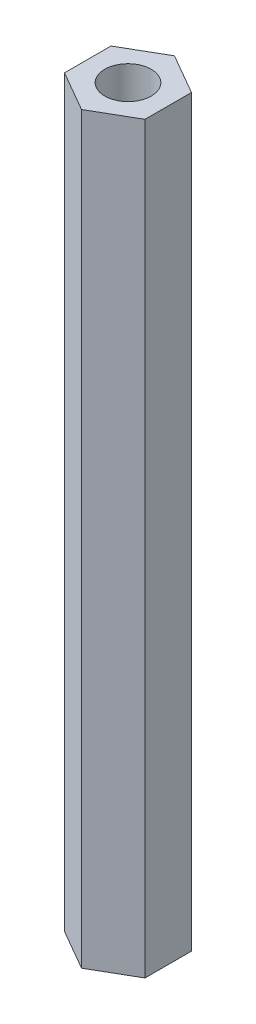
ISO-10303-21;
HEADER;
FILE_DESCRIPTION(('STEP AP214'),'2;1');
FILE_NAME('part.step','',(''),(''),'','','');
FILE_SCHEMA(('AUTOMOTIVE_DESIGN { 1 0 10303 214 1 1 1 1 }'));
ENDSEC;
DATA;
#1=APPLICATION_CONTEXT('core data for automotive mechanical design processes');
#2=APPLICATION_PROTOCOL_DEFINITION('international standard','automotive_design',2000,#1);
#3=PRODUCT_CONTEXT('',#1,'mechanical');
#4=PRODUCT('Part','Part','',(#3));
#5=PRODUCT_RELATED_PRODUCT_CATEGORY('part','',(#4));
#6=PRODUCT_DEFINITION_FORMATION('','',#4);
#7=PRODUCT_DEFINITION_CONTEXT('part definition',#1,'design');
#8=PRODUCT_DEFINITION('design','',#6,#7);
#9=PRODUCT_DEFINITION_SHAPE('','',#8);
#10=(LENGTH_UNIT() NAMED_UNIT(*) SI_UNIT(.MILLI.,.METRE.));
#11=(NAMED_UNIT(*) PLANE_ANGLE_UNIT() SI_UNIT($,.RADIAN.));
#12=(NAMED_UNIT(*) SI_UNIT($,.STERADIAN.) SOLID_ANGLE_UNIT());
#13=UNCERTAINTY_MEASURE_WITH_UNIT(LENGTH_MEASURE(1.E-05),#10,'distance_accuracy_value','');
#14=(GEOMETRIC_REPRESENTATION_CONTEXT(3) GLOBAL_UNCERTAINTY_ASSIGNED_CONTEXT((#13)) GLOBAL_UNIT_ASSIGNED_CONTEXT((#10,
#11,#12)) REPRESENTATION_CONTEXT('',''));
#15=CARTESIAN_POINT('',(0.,0.,0.));
#16=DIRECTION('',(0.,0.,1.));
#17=DIRECTION('',(1.,0.,0.));
#18=AXIS2_PLACEMENT_3D('',#15,#16,#17);
#19=CARTESIAN_POINT('',(0.,80.,-5.));
#20=DIRECTION('',(0.,1.,0.));
#21=DIRECTION('',(0.,0.,1.));
#22=AXIS2_PLACEMENT_3D('',#19,#20,#21);
#23=PLANE('',#22);
#24=DIRECTION('',(-0.866025403784439,0.,-0.5));
#25=VECTOR('',#24,1.);
#26=CARTESIAN_POINT('',(4.33012701892219,80.,-2.5));
#27=LINE('',#26,#25);
#28=CARTESIAN_POINT('',(4.33012701892219,80.,-2.5));
#29=VERTEX_POINT('',#28);
#30=CARTESIAN_POINT('',(0.,80.,-5.));
#31=VERTEX_POINT('',#30);
#32=EDGE_CURVE('E127',#29,#31,#27,.T.);
#33=ORIENTED_EDGE('',*,*,#32,.T.);
#34=DIRECTION('',(-0.866025403784439,0.,0.5));
#35=VECTOR('',#34,1.);
#36=CARTESIAN_POINT('',(0.,80.,-5.));
#37=LINE('',#36,#35);
#38=CARTESIAN_POINT('',(-4.33012701892219,80.,-2.5));
#39=VERTEX_POINT('',#38);
#40=EDGE_CURVE('E85',#31,#39,#37,.T.);
#41=ORIENTED_EDGE('',*,*,#40,.T.);
#42=DIRECTION('',(0.,0.,1.));
#43=VECTOR('',#42,1.);
#44=CARTESIAN_POINT('',(-4.33012701892219,80.,-2.5));
#45=LINE('',#44,#43);
#46=CARTESIAN_POINT('',(-4.33012701892219,80.,2.5));
#47=VERTEX_POINT('',#46);
#48=EDGE_CURVE('E98',#39,#47,#45,.T.);
#49=ORIENTED_EDGE('',*,*,#48,.T.);
#50=DIRECTION('',(0.866025403784439,0.,0.5));
#51=VECTOR('',#50,1.);
#52=CARTESIAN_POINT('',(-4.33012701892219,80.,2.5));
#53=LINE('',#52,#51);
#54=CARTESIAN_POINT('',(0.,80.,5.));
#55=VERTEX_POINT('',#54);
#56=EDGE_CURVE('E92',#47,#55,#53,.T.);
#57=ORIENTED_EDGE('',*,*,#56,.T.);
#58=DIRECTION('',(0.866025403784439,0.,-0.5));
#59=VECTOR('',#58,1.);
#60=CARTESIAN_POINT('',(0.,80.,5.));
#61=LINE('',#60,#59);
#62=CARTESIAN_POINT('',(4.33012701892219,80.,2.5));
#63=VERTEX_POINT('',#62);
#64=EDGE_CURVE('E96',#55,#63,#61,.T.);
#65=ORIENTED_EDGE('',*,*,#64,.T.);
#66=DIRECTION('',(0.,0.,-1.));
#67=VECTOR('',#66,1.);
#68=CARTESIAN_POINT('',(4.33012701892219,80.,2.5));
#69=LINE('',#68,#67);
#70=EDGE_CURVE('E48',#63,#29,#69,.T.);
#71=ORIENTED_EDGE('',*,*,#70,.T.);
#72=EDGE_LOOP('',(#33,#41,#49,#57,#65,#71));
#73=FACE_BOUND('',#72,.T.);
#74=CARTESIAN_POINT('',(0.,80.,0.));
#75=DIRECTION('',(0.,1.,0.));
#76=DIRECTION('',(0.,0.,1.));
#77=AXIS2_PLACEMENT_3D('',#74,#75,#76);
#78=CIRCLE('',#77,2.5);
#79=CARTESIAN_POINT('',(0.,80.,2.5));
#80=VERTEX_POINT('',#79);
#81=EDGE_CURVE('E120',#80,#80,#78,.T.);
#82=ORIENTED_EDGE('',*,*,#81,.F.);
#83=EDGE_LOOP('',(#82));
#84=FACE_BOUND('',#83,.T.);
#85=ADVANCED_FACE('F31',(#73,#84),#23,.T.);
#86=CARTESIAN_POINT('',(0.,0.,-5.));
#87=DIRECTION('',(0.,1.,0.));
#88=DIRECTION('',(0.,0.,1.));
#89=AXIS2_PLACEMENT_3D('',#86,#87,#88);
#90=PLANE('',#89);
#91=DIRECTION('',(-0.866025403784439,0.,-0.5));
#92=VECTOR('',#91,1.);
#93=CARTESIAN_POINT('',(4.33012701892219,0.,-2.5));
#94=LINE('',#93,#92);
#95=CARTESIAN_POINT('',(4.33012701892219,0.,-2.5));
#96=VERTEX_POINT('',#95);
#97=CARTESIAN_POINT('',(0.,0.,-5.));
#98=VERTEX_POINT('',#97);
#99=EDGE_CURVE('E116',#96,#98,#94,.T.);
#100=ORIENTED_EDGE('',*,*,#99,.F.);
#101=DIRECTION('',(0.,0.,-1.));
#102=VECTOR('',#101,1.);
#103=CARTESIAN_POINT('',(4.33012701892219,0.,2.5));
#104=LINE('',#103,#102);
#105=CARTESIAN_POINT('',(4.33012701892219,0.,2.5));
#106=VERTEX_POINT('',#105);
#107=EDGE_CURVE('E77',#106,#96,#104,.T.);
#108=ORIENTED_EDGE('',*,*,#107,.F.);
#109=DIRECTION('',(0.866025403784439,0.,-0.5));
#110=VECTOR('',#109,1.);
#111=CARTESIAN_POINT('',(0.,0.,5.));
#112=LINE('',#111,#110);
#113=CARTESIAN_POINT('',(0.,0.,5.));
#114=VERTEX_POINT('',#113);
#115=EDGE_CURVE('E71',#114,#106,#112,.T.);
#116=ORIENTED_EDGE('',*,*,#115,.F.);
#117=DIRECTION('',(0.866025403784439,0.,0.5));
#118=VECTOR('',#117,1.);
#119=CARTESIAN_POINT('',(-4.33012701892219,0.,2.5));
#120=LINE('',#119,#118);
#121=CARTESIAN_POINT('',(-4.33012701892219,0.,2.5));
#122=VERTEX_POINT('',#121);
#123=EDGE_CURVE('E106',#122,#114,#120,.T.);
#124=ORIENTED_EDGE('',*,*,#123,.F.);
#125=DIRECTION('',(0.,0.,1.));
#126=VECTOR('',#125,1.);
#127=CARTESIAN_POINT('',(-4.33012701892219,0.,-2.5));
#128=LINE('',#127,#126);
#129=CARTESIAN_POINT('',(-4.33012701892219,0.,-2.5));
#130=VERTEX_POINT('',#129);
#131=EDGE_CURVE('E122',#130,#122,#128,.T.);
#132=ORIENTED_EDGE('',*,*,#131,.F.);
#133=DIRECTION('',(-0.866025403784439,0.,0.5));
#134=VECTOR('',#133,1.);
#135=CARTESIAN_POINT('',(0.,0.,-5.));
#136=LINE('',#135,#134);
#137=EDGE_CURVE('E119',#98,#130,#136,.T.);
#138=ORIENTED_EDGE('',*,*,#137,.F.);
#139=EDGE_LOOP('',(#100,#108,#116,#124,#132,#138));
#140=FACE_BOUND('',#139,.T.);
#141=CARTESIAN_POINT('',(0.,0.,0.));
#142=DIRECTION('',(0.,1.,0.));
#143=DIRECTION('',(0.,0.,1.));
#144=AXIS2_PLACEMENT_3D('',#141,#142,#143);
#145=CIRCLE('',#144,2.5);
#146=CARTESIAN_POINT('',(0.,0.,2.5));
#147=VERTEX_POINT('',#146);
#148=EDGE_CURVE('E220',#147,#147,#145,.T.);
#149=ORIENTED_EDGE('',*,*,#148,.T.);
#150=EDGE_LOOP('',(#149));
#151=FACE_BOUND('',#150,.T.);
#152=ADVANCED_FACE('F136',(#140,#151),#90,.F.);
#153=CARTESIAN_POINT('',(4.33012701892219,80.,-2.5));
#154=DIRECTION('',(-0.5,0.,0.866025403784439));
#155=DIRECTION('',(0.866025403784439,0.,0.5));
#156=AXIS2_PLACEMENT_3D('',#153,#154,#155);
#157=PLANE('',#156);
#158=ORIENTED_EDGE('',*,*,#99,.T.);
#159=DIRECTION('',(0.,-1.,0.));
#160=VECTOR('',#159,1.);
#161=CARTESIAN_POINT('',(0.,80.,-5.));
#162=LINE('',#161,#160);
#163=EDGE_CURVE('E11',#31,#98,#162,.T.);
#164=ORIENTED_EDGE('',*,*,#163,.F.);
#165=ORIENTED_EDGE('',*,*,#32,.F.);
#166=DIRECTION('',(0.,-1.,0.));
#167=VECTOR('',#166,1.);
#168=CARTESIAN_POINT('',(4.33012701892219,80.,-2.5));
#169=LINE('',#168,#167);
#170=EDGE_CURVE('E112',#29,#96,#169,.T.);
#171=ORIENTED_EDGE('',*,*,#170,.T.);
#172=EDGE_LOOP('',(#158,#164,#165,#171));
#173=FACE_BOUND('',#172,.T.);
#174=ADVANCED_FACE('F33',(#173),#157,.F.);
#175=CARTESIAN_POINT('',(0.,80.,-5.));
#176=DIRECTION('',(0.5,0.,0.866025403784439));
#177=DIRECTION('',(0.866025403784439,0.,-0.5));
#178=AXIS2_PLACEMENT_3D('',#175,#176,#177);
#179=PLANE('',#178);
#180=ORIENTED_EDGE('',*,*,#137,.T.);
#181=DIRECTION('',(0.,-1.,0.));
#182=VECTOR('',#181,1.);
#183=CARTESIAN_POINT('',(-4.33012701892219,80.,-2.5));
#184=LINE('',#183,#182);
#185=EDGE_CURVE('E40',#39,#130,#184,.T.);
#186=ORIENTED_EDGE('',*,*,#185,.F.);
#187=ORIENTED_EDGE('',*,*,#40,.F.);
#188=ORIENTED_EDGE('',*,*,#163,.T.);
#189=EDGE_LOOP('',(#180,#186,#187,#188));
#190=FACE_BOUND('',#189,.T.);
#191=ADVANCED_FACE('F161',(#190),#179,.F.);
#192=CARTESIAN_POINT('',(-4.33012701892219,80.,-2.5));
#193=DIRECTION('',(1.,0.,0.));
#194=DIRECTION('',(0.,0.,-1.));
#195=AXIS2_PLACEMENT_3D('',#192,#193,#194);
#196=PLANE('',#195);
#197=ORIENTED_EDGE('',*,*,#131,.T.);
#198=DIRECTION('',(0.,-1.,0.));
#199=VECTOR('',#198,1.);
#200=CARTESIAN_POINT('',(-4.33012701892219,80.,2.5));
#201=LINE('',#200,#199);
#202=EDGE_CURVE('E107',#47,#122,#201,.T.);
#203=ORIENTED_EDGE('',*,*,#202,.F.);
#204=ORIENTED_EDGE('',*,*,#48,.F.);
#205=ORIENTED_EDGE('',*,*,#185,.T.);
#206=EDGE_LOOP('',(#197,#203,#204,#205));
#207=FACE_BOUND('',#206,.T.);
#208=ADVANCED_FACE('F133',(#207),#196,.F.);
#209=CARTESIAN_POINT('',(-4.33012701892219,80.,2.5));
#210=DIRECTION('',(0.5,0.,-0.866025403784439));
#211=DIRECTION('',(-0.866025403784439,0.,-0.5));
#212=AXIS2_PLACEMENT_3D('',#209,#210,#211);
#213=PLANE('',#212);
#214=ORIENTED_EDGE('',*,*,#123,.T.);
#215=DIRECTION('',(0.,-1.,0.));
#216=VECTOR('',#215,1.);
#217=CARTESIAN_POINT('',(0.,80.,5.));
#218=LINE('',#217,#216);
#219=EDGE_CURVE('E103',#55,#114,#218,.T.);
#220=ORIENTED_EDGE('',*,*,#219,.F.);
#221=ORIENTED_EDGE('',*,*,#56,.F.);
#222=ORIENTED_EDGE('',*,*,#202,.T.);
#223=EDGE_LOOP('',(#214,#220,#221,#222));
#224=FACE_BOUND('',#223,.T.);
#225=ADVANCED_FACE('F104',(#224),#213,.F.);
#226=CARTESIAN_POINT('',(0.,80.,5.));
#227=DIRECTION('',(-0.5,0.,-0.866025403784439));
#228=DIRECTION('',(-0.866025403784439,0.,0.5));
#229=AXIS2_PLACEMENT_3D('',#226,#227,#228);
#230=PLANE('',#229);
#231=ORIENTED_EDGE('',*,*,#115,.T.);
#232=DIRECTION('',(0.,-1.,0.));
#233=VECTOR('',#232,1.);
#234=CARTESIAN_POINT('',(4.33012701892219,80.,2.5));
#235=LINE('',#234,#233);
#236=EDGE_CURVE('E108',#63,#106,#235,.T.);
#237=ORIENTED_EDGE('',*,*,#236,.F.);
#238=ORIENTED_EDGE('',*,*,#64,.F.);
#239=ORIENTED_EDGE('',*,*,#219,.T.);
#240=EDGE_LOOP('',(#231,#237,#238,#239));
#241=FACE_BOUND('',#240,.T.);
#242=ADVANCED_FACE('F110',(#241),#230,.F.);
#243=CARTESIAN_POINT('',(4.33012701892219,80.,2.5));
#244=DIRECTION('',(-1.,0.,0.));
#245=DIRECTION('',(0.,0.,1.));
#246=AXIS2_PLACEMENT_3D('',#243,#244,#245);
#247=PLANE('',#246);
#248=ORIENTED_EDGE('',*,*,#107,.T.);
#249=ORIENTED_EDGE('',*,*,#170,.F.);
#250=ORIENTED_EDGE('',*,*,#70,.F.);
#251=ORIENTED_EDGE('',*,*,#236,.T.);
#252=EDGE_LOOP('',(#248,#249,#250,#251));
#253=FACE_BOUND('',#252,.T.);
#254=ADVANCED_FACE('F141',(#253),#247,.F.);
#255=CARTESIAN_POINT('',(0.,80.,0.));
#256=DIRECTION('',(0.,-1.,0.));
#257=DIRECTION('',(0.,0.,-1.));
#258=AXIS2_PLACEMENT_3D('',#255,#256,#257);
#259=CYLINDRICAL_SURFACE('',#258,2.5);
#260=ORIENTED_EDGE('',*,*,#81,.T.);
#261=EDGE_LOOP('',(#260));
#262=FACE_BOUND('',#261,.T.);
#263=ORIENTED_EDGE('',*,*,#148,.F.);
#264=EDGE_LOOP('',(#263));
#265=FACE_BOUND('',#264,.T.);
#266=ADVANCED_FACE('F143',(#262,#265),#259,.F.);
#267=CLOSED_SHELL('',(#85,#152,#174,#191,#208,#225,#242,#254,#266));
#268=MANIFOLD_SOLID_BREP('B2',#267);
#269=ADVANCED_BREP_SHAPE_REPRESENTATION('',(#18,#268),#14);
#270=SHAPE_DEFINITION_REPRESENTATION(#9,#269);
ENDSEC;
END-ISO-10303-21;
